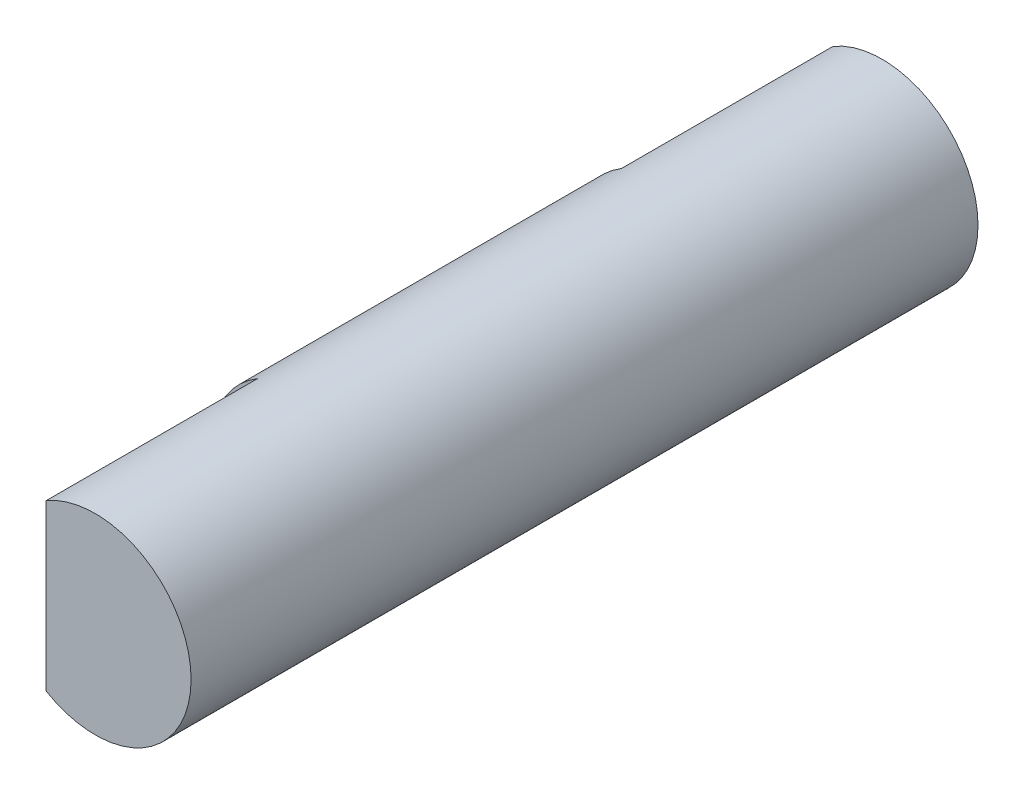
ISO-10303-21;
HEADER;
FILE_DESCRIPTION(('STEP AP214'),'2;1');
FILE_NAME('part.step','',(''),(''),'','','');
FILE_SCHEMA(('AUTOMOTIVE_DESIGN { 1 0 10303 214 1 1 1 1 }'));
ENDSEC;
DATA;
#1=APPLICATION_CONTEXT('core data for automotive mechanical design processes');
#2=APPLICATION_PROTOCOL_DEFINITION('international standard','automotive_design',2000,#1);
#3=PRODUCT_CONTEXT('',#1,'mechanical');
#4=PRODUCT('Part','Part','',(#3));
#5=PRODUCT_RELATED_PRODUCT_CATEGORY('part','',(#4));
#6=PRODUCT_DEFINITION_FORMATION('','',#4);
#7=PRODUCT_DEFINITION_CONTEXT('part definition',#1,'design');
#8=PRODUCT_DEFINITION('design','',#6,#7);
#9=PRODUCT_DEFINITION_SHAPE('','',#8);
#10=(LENGTH_UNIT() NAMED_UNIT(*) SI_UNIT(.MILLI.,.METRE.));
#11=(NAMED_UNIT(*) PLANE_ANGLE_UNIT() SI_UNIT($,.RADIAN.));
#12=(NAMED_UNIT(*) SI_UNIT($,.STERADIAN.) SOLID_ANGLE_UNIT());
#13=UNCERTAINTY_MEASURE_WITH_UNIT(LENGTH_MEASURE(1.E-05),#10,'distance_accuracy_value','');
#14=(GEOMETRIC_REPRESENTATION_CONTEXT(3) GLOBAL_UNCERTAINTY_ASSIGNED_CONTEXT((#13)) GLOBAL_UNIT_ASSIGNED_CONTEXT((#10,
#11,#12)) REPRESENTATION_CONTEXT('',''));
#15=CARTESIAN_POINT('',(0.,0.,0.));
#16=DIRECTION('',(0.,0.,1.));
#17=DIRECTION('',(1.,0.,0.));
#18=AXIS2_PLACEMENT_3D('',#15,#16,#17);
#19=CARTESIAN_POINT('',(0.,0.,8.));
#20=DIRECTION('',(0.,0.,-1.));
#21=DIRECTION('',(-1.,0.,0.));
#22=AXIS2_PLACEMENT_3D('',#19,#20,#21);
#23=CYLINDRICAL_SURFACE('',#22,1.95);
#24=CARTESIAN_POINT('',(0.,0.,-3.7));
#25=DIRECTION('',(0.,0.,-1.));
#26=DIRECTION('',(-1.,0.,0.));
#27=AXIS2_PLACEMENT_3D('',#24,#25,#26);
#28=CIRCLE('',#27,1.95);
#29=CARTESIAN_POINT('',(-1.,-1.67406690427832,-3.7));
#30=VERTEX_POINT('',#29);
#31=CARTESIAN_POINT('',(-1.,1.67406690427832,-3.7));
#32=VERTEX_POINT('',#31);
#33=EDGE_CURVE('E102',#30,#32,#28,.T.);
#34=ORIENTED_EDGE('',*,*,#33,.F.);
#35=DIRECTION('',(0.,0.,-1.));
#36=VECTOR('',#35,1.);
#37=CARTESIAN_POINT('',(-1.,-1.67406690427832,-3.7));
#38=LINE('',#37,#36);
#39=CARTESIAN_POINT('',(-1.,-1.67406690427832,-8.));
#40=VERTEX_POINT('',#39);
#41=EDGE_CURVE('E111',#30,#40,#38,.T.);
#42=ORIENTED_EDGE('',*,*,#41,.T.);
#43=CARTESIAN_POINT('',(0.,0.,-8.));
#44=DIRECTION('',(0.,0.,1.));
#45=DIRECTION('',(1.,0.,0.));
#46=AXIS2_PLACEMENT_3D('',#43,#44,#45);
#47=CIRCLE('',#46,1.95);
#48=CARTESIAN_POINT('',(-1.,1.67406690427832,-8.));
#49=VERTEX_POINT('',#48);
#50=EDGE_CURVE('E42',#40,#49,#47,.T.);
#51=ORIENTED_EDGE('',*,*,#50,.T.);
#52=DIRECTION('',(0.,0.,-1.));
#53=VECTOR('',#52,1.);
#54=CARTESIAN_POINT('',(-1.,1.67406690427832,-3.7));
#55=LINE('',#54,#53);
#56=EDGE_CURVE('E62',#32,#49,#55,.T.);
#57=ORIENTED_EDGE('',*,*,#56,.F.);
#58=EDGE_LOOP('',(#34,#42,#51,#57));
#59=FACE_BOUND('',#58,.T.);
#60=DIRECTION('',(0.,0.,1.));
#61=VECTOR('',#60,1.);
#62=CARTESIAN_POINT('',(-1.,1.67406690427832,3.7));
#63=LINE('',#62,#61);
#64=CARTESIAN_POINT('',(-1.,1.67406690427832,3.7));
#65=VERTEX_POINT('',#64);
#66=CARTESIAN_POINT('',(-1.,1.67406690427832,8.));
#67=VERTEX_POINT('',#66);
#68=EDGE_CURVE('E83',#65,#67,#63,.T.);
#69=ORIENTED_EDGE('',*,*,#68,.T.);
#70=CARTESIAN_POINT('',(0.,0.,8.));
#71=DIRECTION('',(0.,0.,1.));
#72=DIRECTION('',(1.,0.,0.));
#73=AXIS2_PLACEMENT_3D('',#70,#71,#72);
#74=CIRCLE('',#73,1.95);
#75=CARTESIAN_POINT('',(-1.,-1.67406690427832,8.));
#76=VERTEX_POINT('',#75);
#77=EDGE_CURVE('E11',#76,#67,#74,.T.);
#78=ORIENTED_EDGE('',*,*,#77,.F.);
#79=DIRECTION('',(0.,0.,1.));
#80=VECTOR('',#79,1.);
#81=CARTESIAN_POINT('',(-1.,-1.67406690427832,3.7));
#82=LINE('',#81,#80);
#83=CARTESIAN_POINT('',(-1.,-1.67406690427832,3.7));
#84=VERTEX_POINT('',#83);
#85=EDGE_CURVE('E54',#84,#76,#82,.T.);
#86=ORIENTED_EDGE('',*,*,#85,.F.);
#87=CARTESIAN_POINT('',(0.,0.,3.7));
#88=DIRECTION('',(0.,0.,-1.));
#89=DIRECTION('',(-1.,0.,0.));
#90=AXIS2_PLACEMENT_3D('',#87,#88,#89);
#91=CIRCLE('',#90,1.95);
#92=EDGE_CURVE('E87',#84,#65,#91,.T.);
#93=ORIENTED_EDGE('',*,*,#92,.T.);
#94=EDGE_LOOP('',(#69,#78,#86,#93));
#95=FACE_BOUND('',#94,.T.);
#96=ADVANCED_FACE('F39',(#59,#95),#23,.T.);
#97=CARTESIAN_POINT('',(0.,0.,8.));
#98=DIRECTION('',(0.,0.,1.));
#99=DIRECTION('',(1.,0.,0.));
#100=AXIS2_PLACEMENT_3D('',#97,#98,#99);
#101=PLANE('',#100);
#102=ORIENTED_EDGE('',*,*,#77,.T.);
#103=DIRECTION('',(0.,-1.,0.));
#104=VECTOR('',#103,1.);
#105=CARTESIAN_POINT('',(-1.,1.67406690427832,8.));
#106=LINE('',#105,#104);
#107=EDGE_CURVE('E92',#67,#76,#106,.T.);
#108=ORIENTED_EDGE('',*,*,#107,.T.);
#109=EDGE_LOOP('',(#102,#108));
#110=FACE_BOUND('',#109,.T.);
#111=ADVANCED_FACE('F135',(#110),#101,.T.);
#112=CARTESIAN_POINT('',(0.,0.,-8.));
#113=DIRECTION('',(0.,0.,1.));
#114=DIRECTION('',(1.,0.,0.));
#115=AXIS2_PLACEMENT_3D('',#112,#113,#114);
#116=PLANE('',#115);
#117=ORIENTED_EDGE('',*,*,#50,.F.);
#118=DIRECTION('',(0.,-1.,0.));
#119=VECTOR('',#118,1.);
#120=CARTESIAN_POINT('',(-1.,1.67406690427832,-8.));
#121=LINE('',#120,#119);
#122=EDGE_CURVE('E98',#49,#40,#121,.T.);
#123=ORIENTED_EDGE('',*,*,#122,.F.);
#124=EDGE_LOOP('',(#117,#123));
#125=FACE_BOUND('',#124,.T.);
#126=ADVANCED_FACE('F122',(#125),#116,.F.);
#127=CARTESIAN_POINT('',(-1.,1.67406690427832,-3.7));
#128=DIRECTION('',(1.,0.,0.));
#129=DIRECTION('',(0.,0.,-1.));
#130=AXIS2_PLACEMENT_3D('',#127,#128,#129);
#131=PLANE('',#130);
#132=ORIENTED_EDGE('',*,*,#122,.T.);
#133=ORIENTED_EDGE('',*,*,#41,.F.);
#134=DIRECTION('',(0.,-1.,0.));
#135=VECTOR('',#134,1.);
#136=CARTESIAN_POINT('',(-1.,1.67406690427832,-3.7));
#137=LINE('',#136,#135);
#138=EDGE_CURVE('E105',#32,#30,#137,.T.);
#139=ORIENTED_EDGE('',*,*,#138,.F.);
#140=ORIENTED_EDGE('',*,*,#56,.T.);
#141=EDGE_LOOP('',(#132,#133,#139,#140));
#142=FACE_BOUND('',#141,.T.);
#143=ADVANCED_FACE('F123',(#142),#131,.F.);
#144=CARTESIAN_POINT('',(0.,0.,-3.7));
#145=DIRECTION('',(0.,0.,-1.));
#146=DIRECTION('',(-1.,0.,0.));
#147=AXIS2_PLACEMENT_3D('',#144,#145,#146);
#148=PLANE('',#147);
#149=ORIENTED_EDGE('',*,*,#33,.T.);
#150=ORIENTED_EDGE('',*,*,#138,.T.);
#151=EDGE_LOOP('',(#149,#150));
#152=FACE_BOUND('',#151,.T.);
#153=ADVANCED_FACE('F125',(#152),#148,.T.);
#154=CARTESIAN_POINT('',(-1.,1.67406690427832,3.7));
#155=DIRECTION('',(-1.,0.,0.));
#156=DIRECTION('',(0.,0.,1.));
#157=AXIS2_PLACEMENT_3D('',#154,#155,#156);
#158=PLANE('',#157);
#159=ORIENTED_EDGE('',*,*,#107,.F.);
#160=ORIENTED_EDGE('',*,*,#68,.F.);
#161=DIRECTION('',(0.,-1.,0.));
#162=VECTOR('',#161,1.);
#163=CARTESIAN_POINT('',(-1.,1.67406690427832,3.7));
#164=LINE('',#163,#162);
#165=EDGE_CURVE('E79',#65,#84,#164,.T.);
#166=ORIENTED_EDGE('',*,*,#165,.T.);
#167=ORIENTED_EDGE('',*,*,#85,.T.);
#168=EDGE_LOOP('',(#159,#160,#166,#167));
#169=FACE_BOUND('',#168,.T.);
#170=ADVANCED_FACE('F81',(#169),#158,.T.);
#171=CARTESIAN_POINT('',(0.,0.,3.7));
#172=DIRECTION('',(0.,0.,1.));
#173=DIRECTION('',(-1.,0.,0.));
#174=AXIS2_PLACEMENT_3D('',#171,#172,#173);
#175=PLANE('',#174);
#176=ORIENTED_EDGE('',*,*,#92,.F.);
#177=ORIENTED_EDGE('',*,*,#165,.F.);
#178=EDGE_LOOP('',(#176,#177));
#179=FACE_BOUND('',#178,.T.);
#180=ADVANCED_FACE('F89',(#179),#175,.T.);
#181=CLOSED_SHELL('',(#96,#111,#126,#143,#153,#170,#180));
#182=MANIFOLD_SOLID_BREP('B2',#181);
#183=ADVANCED_BREP_SHAPE_REPRESENTATION('',(#18,#182),#14);
#184=SHAPE_DEFINITION_REPRESENTATION(#9,#183);
ENDSEC;
END-ISO-10303-21;
